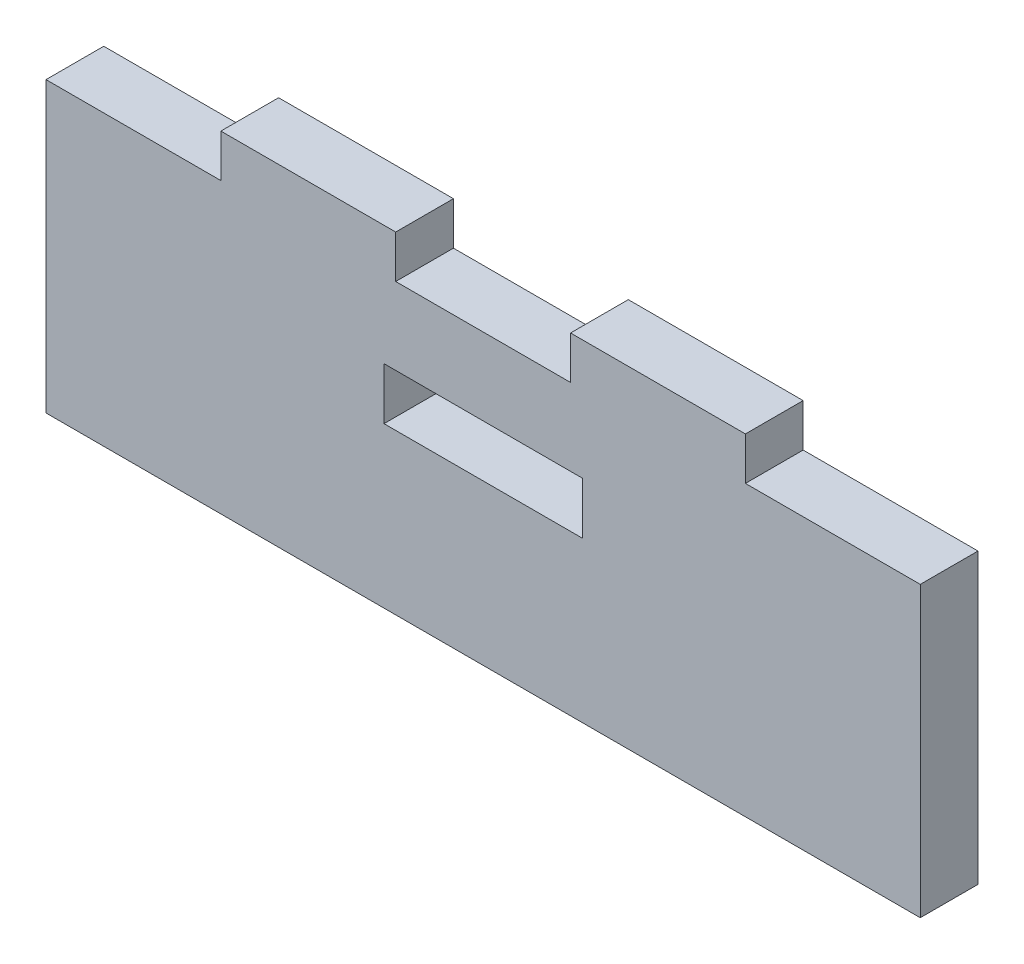
ISO-10303-21;
HEADER;
FILE_DESCRIPTION(('STEP AP214'),'2;1');
FILE_NAME('part.step','',(''),(''),'','','');
FILE_SCHEMA(('AUTOMOTIVE_DESIGN { 1 0 10303 214 1 1 1 1 }'));
ENDSEC;
DATA;
#1=APPLICATION_CONTEXT('core data for automotive mechanical design processes');
#2=APPLICATION_PROTOCOL_DEFINITION('international standard','automotive_design',2000,#1);
#3=PRODUCT_CONTEXT('',#1,'mechanical');
#4=PRODUCT('Part','Part','',(#3));
#5=PRODUCT_RELATED_PRODUCT_CATEGORY('part','',(#4));
#6=PRODUCT_DEFINITION_FORMATION('','',#4);
#7=PRODUCT_DEFINITION_CONTEXT('part definition',#1,'design');
#8=PRODUCT_DEFINITION('design','',#6,#7);
#9=PRODUCT_DEFINITION_SHAPE('','',#8);
#10=(LENGTH_UNIT() NAMED_UNIT(*) SI_UNIT(.MILLI.,.METRE.));
#11=(NAMED_UNIT(*) PLANE_ANGLE_UNIT() SI_UNIT($,.RADIAN.));
#12=(NAMED_UNIT(*) SI_UNIT($,.STERADIAN.) SOLID_ANGLE_UNIT());
#13=UNCERTAINTY_MEASURE_WITH_UNIT(LENGTH_MEASURE(1.E-05),#10,'distance_accuracy_value','');
#14=(GEOMETRIC_REPRESENTATION_CONTEXT(3) GLOBAL_UNCERTAINTY_ASSIGNED_CONTEXT((#13)) GLOBAL_UNIT_ASSIGNED_CONTEXT((#10,
#11,#12)) REPRESENTATION_CONTEXT('',''));
#15=CARTESIAN_POINT('',(0.,0.,0.));
#16=DIRECTION('',(0.,0.,1.));
#17=DIRECTION('',(1.,0.,0.));
#18=AXIS2_PLACEMENT_3D('',#15,#16,#17);
#19=CARTESIAN_POINT('',(0.,0.,3.));
#20=DIRECTION('',(0.,0.,1.));
#21=DIRECTION('',(1.,0.,0.));
#22=AXIS2_PLACEMENT_3D('',#19,#20,#21);
#23=PLANE('',#22);
#24=DIRECTION('',(0.,-1.,0.));
#25=VECTOR('',#24,1.);
#26=CARTESIAN_POINT('',(-25.5422119713162,10.7357244848707,3.));
#27=LINE('',#26,#25);
#28=CARTESIAN_POINT('',(-25.5422119713162,10.7357244848707,3.));
#29=VERTEX_POINT('',#28);
#30=CARTESIAN_POINT('',(-25.5422119713162,-4.26427551512934,3.));
#31=VERTEX_POINT('',#30);
#32=EDGE_CURVE('E181',#29,#31,#27,.T.);
#33=ORIENTED_EDGE('',*,*,#32,.T.);
#34=DIRECTION('',(1.,0.,0.));
#35=VECTOR('',#34,1.);
#36=CARTESIAN_POINT('',(-25.5422119713162,-4.26427551512934,3.));
#37=LINE('',#36,#35);
#38=CARTESIAN_POINT('',(19.8777880286838,-4.26427551512934,3.));
#39=VERTEX_POINT('',#38);
#40=EDGE_CURVE('E184',#31,#39,#37,.T.);
#41=ORIENTED_EDGE('',*,*,#40,.T.);
#42=DIRECTION('',(0.,1.,0.));
#43=VECTOR('',#42,1.);
#44=CARTESIAN_POINT('',(19.8777880286838,10.7357244848707,3.));
#45=LINE('',#44,#43);
#46=CARTESIAN_POINT('',(19.8777880286838,10.7357244848707,3.));
#47=VERTEX_POINT('',#46);
#48=EDGE_CURVE('E187',#39,#47,#45,.T.);
#49=ORIENTED_EDGE('',*,*,#48,.T.);
#50=DIRECTION('',(-1.,0.,0.));
#51=VECTOR('',#50,1.);
#52=CARTESIAN_POINT('',(10.7937880286838,10.7357244848707,3.));
#53=LINE('',#52,#51);
#54=CARTESIAN_POINT('',(10.7937880286838,10.7357244848707,3.));
#55=VERTEX_POINT('',#54);
#56=EDGE_CURVE('E189',#47,#55,#53,.T.);
#57=ORIENTED_EDGE('',*,*,#56,.T.);
#58=DIRECTION('',(0.,1.,0.));
#59=VECTOR('',#58,1.);
#60=CARTESIAN_POINT('',(10.7937880286838,10.7357244848707,3.));
#61=LINE('',#60,#59);
#62=CARTESIAN_POINT('',(10.7937880286838,12.9620559634134,3.));
#63=VERTEX_POINT('',#62);
#64=EDGE_CURVE('E191',#55,#63,#61,.T.);
#65=ORIENTED_EDGE('',*,*,#64,.T.);
#66=DIRECTION('',(-1.,0.,0.));
#67=VECTOR('',#66,1.);
#68=CARTESIAN_POINT('',(10.7937880286838,12.9620559634134,3.));
#69=LINE('',#68,#67);
#70=CARTESIAN_POINT('',(1.70978802868379,12.9620559634134,3.));
#71=VERTEX_POINT('',#70);
#72=EDGE_CURVE('E193',#63,#71,#69,.T.);
#73=ORIENTED_EDGE('',*,*,#72,.T.);
#74=DIRECTION('',(0.,-1.,0.));
#75=VECTOR('',#74,1.);
#76=CARTESIAN_POINT('',(1.70978802868379,10.7357244848707,3.));
#77=LINE('',#76,#75);
#78=CARTESIAN_POINT('',(1.70978802868379,10.7357244848707,3.));
#79=VERTEX_POINT('',#78);
#80=EDGE_CURVE('E195',#71,#79,#77,.T.);
#81=ORIENTED_EDGE('',*,*,#80,.T.);
#82=DIRECTION('',(-1.,0.,0.));
#83=VECTOR('',#82,1.);
#84=CARTESIAN_POINT('',(-7.37421197131621,10.7357244848707,3.));
#85=LINE('',#84,#83);
#86=CARTESIAN_POINT('',(-7.37421197131621,10.7357244848707,3.));
#87=VERTEX_POINT('',#86);
#88=EDGE_CURVE('E197',#79,#87,#85,.T.);
#89=ORIENTED_EDGE('',*,*,#88,.T.);
#90=DIRECTION('',(0.,1.,0.));
#91=VECTOR('',#90,1.);
#92=CARTESIAN_POINT('',(-7.37421197131621,10.7357244848707,3.));
#93=LINE('',#92,#91);
#94=CARTESIAN_POINT('',(-7.37421197131621,12.9620559634134,3.));
#95=VERTEX_POINT('',#94);
#96=EDGE_CURVE('E199',#87,#95,#93,.T.);
#97=ORIENTED_EDGE('',*,*,#96,.T.);
#98=DIRECTION('',(-1.,0.,0.));
#99=VECTOR('',#98,1.);
#100=CARTESIAN_POINT('',(-7.37421197131621,12.9620559634134,3.));
#101=LINE('',#100,#99);
#102=CARTESIAN_POINT('',(-16.4582119713162,12.9620559634134,3.));
#103=VERTEX_POINT('',#102);
#104=EDGE_CURVE('E201',#95,#103,#101,.T.);
#105=ORIENTED_EDGE('',*,*,#104,.T.);
#106=DIRECTION('',(0.,-1.,0.));
#107=VECTOR('',#106,1.);
#108=CARTESIAN_POINT('',(-16.4582119713162,10.7357244848707,3.));
#109=LINE('',#108,#107);
#110=CARTESIAN_POINT('',(-16.4582119713162,10.7357244848707,3.));
#111=VERTEX_POINT('',#110);
#112=EDGE_CURVE('E203',#103,#111,#109,.T.);
#113=ORIENTED_EDGE('',*,*,#112,.T.);
#114=DIRECTION('',(-1.,0.,0.));
#115=VECTOR('',#114,1.);
#116=CARTESIAN_POINT('',(-25.5422119713162,10.7357244848707,3.));
#117=LINE('',#116,#115);
#118=EDGE_CURVE('E205',#111,#29,#117,.T.);
#119=ORIENTED_EDGE('',*,*,#118,.T.);
#120=EDGE_LOOP('',(#33,#41,#49,#57,#65,#73,#81,#89,#97,#105,#113,#119));
#121=FACE_BOUND('',#120,.T.);
#122=DIRECTION('',(1.,0.,0.));
#123=VECTOR('',#122,1.);
#124=CARTESIAN_POINT('',(-7.9822119713162,4.03572448487066,3.));
#125=LINE('',#124,#123);
#126=CARTESIAN_POINT('',(-7.9822119713162,4.03572448487066,3.));
#127=VERTEX_POINT('',#126);
#128=CARTESIAN_POINT('',(2.3177880286838,4.03572448487066,3.));
#129=VERTEX_POINT('',#128);
#130=EDGE_CURVE('E153',#127,#129,#125,.T.);
#131=ORIENTED_EDGE('',*,*,#130,.F.);
#132=DIRECTION('',(0.,-1.,0.));
#133=VECTOR('',#132,1.);
#134=CARTESIAN_POINT('',(-7.9822119713162,6.73572448487066,3.));
#135=LINE('',#134,#133);
#136=CARTESIAN_POINT('',(-7.9822119713162,6.73572448487066,3.));
#137=VERTEX_POINT('',#136);
#138=EDGE_CURVE('E145',#137,#127,#135,.T.);
#139=ORIENTED_EDGE('',*,*,#138,.F.);
#140=DIRECTION('',(-1.,0.,0.));
#141=VECTOR('',#140,1.);
#142=CARTESIAN_POINT('',(-7.9822119713162,6.73572448487066,3.));
#143=LINE('',#142,#141);
#144=CARTESIAN_POINT('',(2.3177880286838,6.73572448487066,3.));
#145=VERTEX_POINT('',#144);
#146=EDGE_CURVE('E167',#145,#137,#143,.T.);
#147=ORIENTED_EDGE('',*,*,#146,.F.);
#148=DIRECTION('',(0.,1.,0.));
#149=VECTOR('',#148,1.);
#150=CARTESIAN_POINT('',(2.3177880286838,6.73572448487066,3.));
#151=LINE('',#150,#149);
#152=EDGE_CURVE('E165',#129,#145,#151,.T.);
#153=ORIENTED_EDGE('',*,*,#152,.F.);
#154=EDGE_LOOP('',(#131,#139,#147,#153));
#155=FACE_BOUND('',#154,.T.);
#156=ADVANCED_FACE('F32',(#121,#155),#23,.T.);
#157=CARTESIAN_POINT('',(0.,0.,0.));
#158=DIRECTION('',(0.,0.,1.));
#159=DIRECTION('',(1.,0.,0.));
#160=AXIS2_PLACEMENT_3D('',#157,#158,#159);
#161=PLANE('',#160);
#162=DIRECTION('',(0.,-1.,0.));
#163=VECTOR('',#162,1.);
#164=CARTESIAN_POINT('',(-25.5422119713162,10.7357244848707,0.));
#165=LINE('',#164,#163);
#166=CARTESIAN_POINT('',(-25.5422119713162,10.7357244848707,0.));
#167=VERTEX_POINT('',#166);
#168=CARTESIAN_POINT('',(-25.5422119713162,-4.26427551512934,0.));
#169=VERTEX_POINT('',#168);
#170=EDGE_CURVE('E161',#167,#169,#165,.T.);
#171=ORIENTED_EDGE('',*,*,#170,.F.);
#172=DIRECTION('',(-1.,0.,0.));
#173=VECTOR('',#172,1.);
#174=CARTESIAN_POINT('',(-25.5422119713162,10.7357244848707,0.));
#175=LINE('',#174,#173);
#176=CARTESIAN_POINT('',(-16.4582119713162,10.7357244848707,0.));
#177=VERTEX_POINT('',#176);
#178=EDGE_CURVE('E185',#177,#167,#175,.T.);
#179=ORIENTED_EDGE('',*,*,#178,.F.);
#180=DIRECTION('',(0.,-1.,0.));
#181=VECTOR('',#180,1.);
#182=CARTESIAN_POINT('',(-16.4582119713162,10.7357244848707,0.));
#183=LINE('',#182,#181);
#184=CARTESIAN_POINT('',(-16.4582119713162,12.9620559634134,0.));
#185=VERTEX_POINT('',#184);
#186=EDGE_CURVE('E228',#185,#177,#183,.T.);
#187=ORIENTED_EDGE('',*,*,#186,.F.);
#188=DIRECTION('',(-1.,0.,0.));
#189=VECTOR('',#188,1.);
#190=CARTESIAN_POINT('',(-7.37421197131621,12.9620559634134,0.));
#191=LINE('',#190,#189);
#192=CARTESIAN_POINT('',(-7.37421197131621,12.9620559634134,0.));
#193=VERTEX_POINT('',#192);
#194=EDGE_CURVE('E226',#193,#185,#191,.T.);
#195=ORIENTED_EDGE('',*,*,#194,.F.);
#196=DIRECTION('',(0.,1.,0.));
#197=VECTOR('',#196,1.);
#198=CARTESIAN_POINT('',(-7.37421197131621,10.7357244848707,0.));
#199=LINE('',#198,#197);
#200=CARTESIAN_POINT('',(-7.37421197131621,10.7357244848707,0.));
#201=VERTEX_POINT('',#200);
#202=EDGE_CURVE('E224',#201,#193,#199,.T.);
#203=ORIENTED_EDGE('',*,*,#202,.F.);
#204=DIRECTION('',(-1.,0.,0.));
#205=VECTOR('',#204,1.);
#206=CARTESIAN_POINT('',(-7.37421197131621,10.7357244848707,0.));
#207=LINE('',#206,#205);
#208=CARTESIAN_POINT('',(1.70978802868379,10.7357244848707,0.));
#209=VERTEX_POINT('',#208);
#210=EDGE_CURVE('E222',#209,#201,#207,.T.);
#211=ORIENTED_EDGE('',*,*,#210,.F.);
#212=DIRECTION('',(0.,-1.,0.));
#213=VECTOR('',#212,1.);
#214=CARTESIAN_POINT('',(1.70978802868379,10.7357244848707,0.));
#215=LINE('',#214,#213);
#216=CARTESIAN_POINT('',(1.70978802868379,12.9620559634134,0.));
#217=VERTEX_POINT('',#216);
#218=EDGE_CURVE('E220',#217,#209,#215,.T.);
#219=ORIENTED_EDGE('',*,*,#218,.F.);
#220=DIRECTION('',(-1.,0.,0.));
#221=VECTOR('',#220,1.);
#222=CARTESIAN_POINT('',(10.7937880286838,12.9620559634134,0.));
#223=LINE('',#222,#221);
#224=CARTESIAN_POINT('',(10.7937880286838,12.9620559634134,0.));
#225=VERTEX_POINT('',#224);
#226=EDGE_CURVE('E218',#225,#217,#223,.T.);
#227=ORIENTED_EDGE('',*,*,#226,.F.);
#228=DIRECTION('',(0.,1.,0.));
#229=VECTOR('',#228,1.);
#230=CARTESIAN_POINT('',(10.7937880286838,10.7357244848707,0.));
#231=LINE('',#230,#229);
#232=CARTESIAN_POINT('',(10.7937880286838,10.7357244848707,0.));
#233=VERTEX_POINT('',#232);
#234=EDGE_CURVE('E216',#233,#225,#231,.T.);
#235=ORIENTED_EDGE('',*,*,#234,.F.);
#236=DIRECTION('',(-1.,0.,0.));
#237=VECTOR('',#236,1.);
#238=CARTESIAN_POINT('',(10.7937880286838,10.7357244848707,0.));
#239=LINE('',#238,#237);
#240=CARTESIAN_POINT('',(19.8777880286838,10.7357244848707,0.));
#241=VERTEX_POINT('',#240);
#242=EDGE_CURVE('E214',#241,#233,#239,.T.);
#243=ORIENTED_EDGE('',*,*,#242,.F.);
#244=DIRECTION('',(0.,1.,0.));
#245=VECTOR('',#244,1.);
#246=CARTESIAN_POINT('',(19.8777880286838,10.7357244848707,0.));
#247=LINE('',#246,#245);
#248=CARTESIAN_POINT('',(19.8777880286838,-4.26427551512934,0.));
#249=VERTEX_POINT('',#248);
#250=EDGE_CURVE('E212',#249,#241,#247,.T.);
#251=ORIENTED_EDGE('',*,*,#250,.F.);
#252=DIRECTION('',(1.,0.,0.));
#253=VECTOR('',#252,1.);
#254=CARTESIAN_POINT('',(-25.5422119713162,-4.26427551512934,0.));
#255=LINE('',#254,#253);
#256=EDGE_CURVE('E210',#169,#249,#255,.T.);
#257=ORIENTED_EDGE('',*,*,#256,.F.);
#258=EDGE_LOOP('',(#171,#179,#187,#195,#203,#211,#219,#227,#235,#243,#251,#257));
#259=FACE_BOUND('',#258,.T.);
#260=DIRECTION('',(0.,-1.,0.));
#261=VECTOR('',#260,1.);
#262=CARTESIAN_POINT('',(-7.9822119713162,6.73572448487066,0.));
#263=LINE('',#262,#261);
#264=CARTESIAN_POINT('',(-7.9822119713162,6.73572448487066,0.));
#265=VERTEX_POINT('',#264);
#266=CARTESIAN_POINT('',(-7.9822119713162,4.03572448487066,0.));
#267=VERTEX_POINT('',#266);
#268=EDGE_CURVE('E55',#265,#267,#263,.T.);
#269=ORIENTED_EDGE('',*,*,#268,.T.);
#270=DIRECTION('',(1.,0.,0.));
#271=VECTOR('',#270,1.);
#272=CARTESIAN_POINT('',(-7.9822119713162,4.03572448487066,0.));
#273=LINE('',#272,#271);
#274=CARTESIAN_POINT('',(2.3177880286838,4.03572448487066,0.));
#275=VERTEX_POINT('',#274);
#276=EDGE_CURVE('E160',#267,#275,#273,.T.);
#277=ORIENTED_EDGE('',*,*,#276,.T.);
#278=DIRECTION('',(0.,1.,0.));
#279=VECTOR('',#278,1.);
#280=CARTESIAN_POINT('',(2.3177880286838,6.73572448487066,0.));
#281=LINE('',#280,#279);
#282=CARTESIAN_POINT('',(2.3177880286838,6.73572448487066,0.));
#283=VERTEX_POINT('',#282);
#284=EDGE_CURVE('E173',#275,#283,#281,.T.);
#285=ORIENTED_EDGE('',*,*,#284,.T.);
#286=DIRECTION('',(-1.,0.,0.));
#287=VECTOR('',#286,1.);
#288=CARTESIAN_POINT('',(-7.9822119713162,6.73572448487066,0.));
#289=LINE('',#288,#287);
#290=EDGE_CURVE('E154',#283,#265,#289,.T.);
#291=ORIENTED_EDGE('',*,*,#290,.T.);
#292=EDGE_LOOP('',(#269,#277,#285,#291));
#293=FACE_BOUND('',#292,.T.);
#294=ADVANCED_FACE('F270',(#259,#293),#161,.F.);
#295=CARTESIAN_POINT('',(-25.5422119713162,10.7357244848707,3.));
#296=DIRECTION('',(1.,0.,0.));
#297=DIRECTION('',(0.,1.,0.));
#298=AXIS2_PLACEMENT_3D('',#295,#296,#297);
#299=PLANE('',#298);
#300=ORIENTED_EDGE('',*,*,#170,.T.);
#301=DIRECTION('',(0.,0.,-1.));
#302=VECTOR('',#301,1.);
#303=CARTESIAN_POINT('',(-25.5422119713162,-4.26427551512934,3.));
#304=LINE('',#303,#302);
#305=EDGE_CURVE('E11',#31,#169,#304,.T.);
#306=ORIENTED_EDGE('',*,*,#305,.F.);
#307=ORIENTED_EDGE('',*,*,#32,.F.);
#308=DIRECTION('',(0.,0.,-1.));
#309=VECTOR('',#308,1.);
#310=CARTESIAN_POINT('',(-25.5422119713162,10.7357244848707,3.));
#311=LINE('',#310,#309);
#312=EDGE_CURVE('E207',#29,#167,#311,.T.);
#313=ORIENTED_EDGE('',*,*,#312,.T.);
#314=EDGE_LOOP('',(#300,#306,#307,#313));
#315=FACE_BOUND('',#314,.T.);
#316=ADVANCED_FACE('F34',(#315),#299,.F.);
#317=CARTESIAN_POINT('',(-25.5422119713162,-4.26427551512934,3.));
#318=DIRECTION('',(0.,1.,0.));
#319=DIRECTION('',(0.,0.,1.));
#320=AXIS2_PLACEMENT_3D('',#317,#318,#319);
#321=PLANE('',#320);
#322=ORIENTED_EDGE('',*,*,#256,.T.);
#323=DIRECTION('',(0.,0.,-1.));
#324=VECTOR('',#323,1.);
#325=CARTESIAN_POINT('',(19.8777880286838,-4.26427551512934,3.));
#326=LINE('',#325,#324);
#327=EDGE_CURVE('E40',#39,#249,#326,.T.);
#328=ORIENTED_EDGE('',*,*,#327,.F.);
#329=ORIENTED_EDGE('',*,*,#40,.F.);
#330=ORIENTED_EDGE('',*,*,#305,.T.);
#331=EDGE_LOOP('',(#322,#328,#329,#330));
#332=FACE_BOUND('',#331,.T.);
#333=ADVANCED_FACE('F287',(#332),#321,.F.);
#334=CARTESIAN_POINT('',(19.8777880286838,10.7357244848707,3.));
#335=DIRECTION('',(-1.,0.,0.));
#336=DIRECTION('',(0.,-1.,0.));
#337=AXIS2_PLACEMENT_3D('',#334,#335,#336);
#338=PLANE('',#337);
#339=ORIENTED_EDGE('',*,*,#250,.T.);
#340=DIRECTION('',(0.,0.,-1.));
#341=VECTOR('',#340,1.);
#342=CARTESIAN_POINT('',(19.8777880286838,10.7357244848707,3.));
#343=LINE('',#342,#341);
#344=EDGE_CURVE('E257',#47,#241,#343,.T.);
#345=ORIENTED_EDGE('',*,*,#344,.F.);
#346=ORIENTED_EDGE('',*,*,#48,.F.);
#347=ORIENTED_EDGE('',*,*,#327,.T.);
#348=EDGE_LOOP('',(#339,#345,#346,#347));
#349=FACE_BOUND('',#348,.T.);
#350=ADVANCED_FACE('F264',(#349),#338,.F.);
#351=CARTESIAN_POINT('',(10.7937880286838,10.7357244848707,3.));
#352=DIRECTION('',(0.,-1.,0.));
#353=DIRECTION('',(1.,0.,0.));
#354=AXIS2_PLACEMENT_3D('',#351,#352,#353);
#355=PLANE('',#354);
#356=ORIENTED_EDGE('',*,*,#242,.T.);
#357=DIRECTION('',(0.,0.,-1.));
#358=VECTOR('',#357,1.);
#359=CARTESIAN_POINT('',(10.7937880286838,10.7357244848707,3.));
#360=LINE('',#359,#358);
#361=EDGE_CURVE('E254',#55,#233,#360,.T.);
#362=ORIENTED_EDGE('',*,*,#361,.F.);
#363=ORIENTED_EDGE('',*,*,#56,.F.);
#364=ORIENTED_EDGE('',*,*,#344,.T.);
#365=EDGE_LOOP('',(#356,#362,#363,#364));
#366=FACE_BOUND('',#365,.T.);
#367=ADVANCED_FACE('F276',(#366),#355,.F.);
#368=CARTESIAN_POINT('',(10.7937880286838,10.7357244848707,3.));
#369=DIRECTION('',(-1.,0.,0.));
#370=DIRECTION('',(0.,0.,1.));
#371=AXIS2_PLACEMENT_3D('',#368,#369,#370);
#372=PLANE('',#371);
#373=ORIENTED_EDGE('',*,*,#234,.T.);
#374=DIRECTION('',(0.,0.,-1.));
#375=VECTOR('',#374,1.);
#376=CARTESIAN_POINT('',(10.7937880286838,12.9620559634134,3.));
#377=LINE('',#376,#375);
#378=EDGE_CURVE('E251',#63,#225,#377,.T.);
#379=ORIENTED_EDGE('',*,*,#378,.F.);
#380=ORIENTED_EDGE('',*,*,#64,.F.);
#381=ORIENTED_EDGE('',*,*,#361,.T.);
#382=EDGE_LOOP('',(#373,#379,#380,#381));
#383=FACE_BOUND('',#382,.T.);
#384=ADVANCED_FACE('F280',(#383),#372,.F.);
#385=CARTESIAN_POINT('',(10.7937880286838,12.9620559634134,3.));
#386=DIRECTION('',(0.,-1.,0.));
#387=DIRECTION('',(1.,0.,0.));
#388=AXIS2_PLACEMENT_3D('',#385,#386,#387);
#389=PLANE('',#388);
#390=ORIENTED_EDGE('',*,*,#226,.T.);
#391=DIRECTION('',(0.,0.,-1.));
#392=VECTOR('',#391,1.);
#393=CARTESIAN_POINT('',(1.70978802868379,12.9620559634134,3.));
#394=LINE('',#393,#392);
#395=EDGE_CURVE('E248',#71,#217,#394,.T.);
#396=ORIENTED_EDGE('',*,*,#395,.F.);
#397=ORIENTED_EDGE('',*,*,#72,.F.);
#398=ORIENTED_EDGE('',*,*,#378,.T.);
#399=EDGE_LOOP('',(#390,#396,#397,#398));
#400=FACE_BOUND('',#399,.T.);
#401=ADVANCED_FACE('F320',(#400),#389,.F.);
#402=CARTESIAN_POINT('',(1.70978802868379,10.7357244848707,3.));
#403=DIRECTION('',(1.,0.,0.));
#404=DIRECTION('',(0.,1.,0.));
#405=AXIS2_PLACEMENT_3D('',#402,#403,#404);
#406=PLANE('',#405);
#407=ORIENTED_EDGE('',*,*,#218,.T.);
#408=DIRECTION('',(0.,0.,-1.));
#409=VECTOR('',#408,1.);
#410=CARTESIAN_POINT('',(1.70978802868379,10.7357244848707,3.));
#411=LINE('',#410,#409);
#412=EDGE_CURVE('E245',#79,#209,#411,.T.);
#413=ORIENTED_EDGE('',*,*,#412,.F.);
#414=ORIENTED_EDGE('',*,*,#80,.F.);
#415=ORIENTED_EDGE('',*,*,#395,.T.);
#416=EDGE_LOOP('',(#407,#413,#414,#415));
#417=FACE_BOUND('',#416,.T.);
#418=ADVANCED_FACE('F318',(#417),#406,.F.);
#419=CARTESIAN_POINT('',(-7.37421197131621,10.7357244848707,3.));
#420=DIRECTION('',(0.,-1.,0.));
#421=DIRECTION('',(0.,0.,-1.));
#422=AXIS2_PLACEMENT_3D('',#419,#420,#421);
#423=PLANE('',#422);
#424=ORIENTED_EDGE('',*,*,#210,.T.);
#425=DIRECTION('',(0.,0.,-1.));
#426=VECTOR('',#425,1.);
#427=CARTESIAN_POINT('',(-7.37421197131621,10.7357244848707,3.));
#428=LINE('',#427,#426);
#429=EDGE_CURVE('E242',#87,#201,#428,.T.);
#430=ORIENTED_EDGE('',*,*,#429,.F.);
#431=ORIENTED_EDGE('',*,*,#88,.F.);
#432=ORIENTED_EDGE('',*,*,#412,.T.);
#433=EDGE_LOOP('',(#424,#430,#431,#432));
#434=FACE_BOUND('',#433,.T.);
#435=ADVANCED_FACE('F314',(#434),#423,.F.);
#436=CARTESIAN_POINT('',(-7.37421197131621,10.7357244848707,3.));
#437=DIRECTION('',(-1.,0.,0.));
#438=DIRECTION('',(0.,0.,1.));
#439=AXIS2_PLACEMENT_3D('',#436,#437,#438);
#440=PLANE('',#439);
#441=ORIENTED_EDGE('',*,*,#202,.T.);
#442=DIRECTION('',(0.,0.,-1.));
#443=VECTOR('',#442,1.);
#444=CARTESIAN_POINT('',(-7.37421197131621,12.9620559634134,3.));
#445=LINE('',#444,#443);
#446=EDGE_CURVE('E239',#95,#193,#445,.T.);
#447=ORIENTED_EDGE('',*,*,#446,.F.);
#448=ORIENTED_EDGE('',*,*,#96,.F.);
#449=ORIENTED_EDGE('',*,*,#429,.T.);
#450=EDGE_LOOP('',(#441,#447,#448,#449));
#451=FACE_BOUND('',#450,.T.);
#452=ADVANCED_FACE('F309',(#451),#440,.F.);
#453=CARTESIAN_POINT('',(-7.37421197131621,12.9620559634134,3.));
#454=DIRECTION('',(0.,-1.,0.));
#455=DIRECTION('',(1.,0.,0.));
#456=AXIS2_PLACEMENT_3D('',#453,#454,#455);
#457=PLANE('',#456);
#458=ORIENTED_EDGE('',*,*,#194,.T.);
#459=DIRECTION('',(0.,0.,-1.));
#460=VECTOR('',#459,1.);
#461=CARTESIAN_POINT('',(-16.4582119713162,12.9620559634134,3.));
#462=LINE('',#461,#460);
#463=EDGE_CURVE('E236',#103,#185,#462,.T.);
#464=ORIENTED_EDGE('',*,*,#463,.F.);
#465=ORIENTED_EDGE('',*,*,#104,.F.);
#466=ORIENTED_EDGE('',*,*,#446,.T.);
#467=EDGE_LOOP('',(#458,#464,#465,#466));
#468=FACE_BOUND('',#467,.T.);
#469=ADVANCED_FACE('F303',(#468),#457,.F.);
#470=CARTESIAN_POINT('',(-16.4582119713162,10.7357244848707,3.));
#471=DIRECTION('',(1.,0.,0.));
#472=DIRECTION('',(0.,0.,-1.));
#473=AXIS2_PLACEMENT_3D('',#470,#471,#472);
#474=PLANE('',#473);
#475=ORIENTED_EDGE('',*,*,#186,.T.);
#476=DIRECTION('',(0.,0.,-1.));
#477=VECTOR('',#476,1.);
#478=CARTESIAN_POINT('',(-16.4582119713162,10.7357244848707,3.));
#479=LINE('',#478,#477);
#480=EDGE_CURVE('E233',#111,#177,#479,.T.);
#481=ORIENTED_EDGE('',*,*,#480,.F.);
#482=ORIENTED_EDGE('',*,*,#112,.F.);
#483=ORIENTED_EDGE('',*,*,#463,.T.);
#484=EDGE_LOOP('',(#475,#481,#482,#483));
#485=FACE_BOUND('',#484,.T.);
#486=ADVANCED_FACE('F299',(#485),#474,.F.);
#487=CARTESIAN_POINT('',(-25.5422119713162,10.7357244848707,3.));
#488=DIRECTION('',(0.,-1.,0.));
#489=DIRECTION('',(1.,0.,0.));
#490=AXIS2_PLACEMENT_3D('',#487,#488,#489);
#491=PLANE('',#490);
#492=ORIENTED_EDGE('',*,*,#178,.T.);
#493=ORIENTED_EDGE('',*,*,#312,.F.);
#494=ORIENTED_EDGE('',*,*,#118,.F.);
#495=ORIENTED_EDGE('',*,*,#480,.T.);
#496=EDGE_LOOP('',(#492,#493,#494,#495));
#497=FACE_BOUND('',#496,.T.);
#498=ADVANCED_FACE('F294',(#497),#491,.F.);
#499=CARTESIAN_POINT('',(-7.9822119713162,6.73572448487066,3.));
#500=DIRECTION('',(1.,0.,0.));
#501=DIRECTION('',(0.,1.,0.));
#502=AXIS2_PLACEMENT_3D('',#499,#500,#501);
#503=PLANE('',#502);
#504=ORIENTED_EDGE('',*,*,#268,.F.);
#505=DIRECTION('',(0.,0.,-1.));
#506=VECTOR('',#505,1.);
#507=CARTESIAN_POINT('',(-7.9822119713162,6.73572448487066,3.));
#508=LINE('',#507,#506);
#509=EDGE_CURVE('E149',#137,#265,#508,.T.);
#510=ORIENTED_EDGE('',*,*,#509,.F.);
#511=ORIENTED_EDGE('',*,*,#138,.T.);
#512=DIRECTION('',(0.,0.,-1.));
#513=VECTOR('',#512,1.);
#514=CARTESIAN_POINT('',(-7.9822119713162,4.03572448487066,3.));
#515=LINE('',#514,#513);
#516=EDGE_CURVE('E148',#127,#267,#515,.T.);
#517=ORIENTED_EDGE('',*,*,#516,.T.);
#518=EDGE_LOOP('',(#504,#510,#511,#517));
#519=FACE_BOUND('',#518,.T.);
#520=ADVANCED_FACE('F147',(#519),#503,.T.);
#521=CARTESIAN_POINT('',(-7.9822119713162,4.03572448487066,3.));
#522=DIRECTION('',(0.,1.,0.));
#523=DIRECTION('',(0.,0.,1.));
#524=AXIS2_PLACEMENT_3D('',#521,#522,#523);
#525=PLANE('',#524);
#526=ORIENTED_EDGE('',*,*,#276,.F.);
#527=ORIENTED_EDGE('',*,*,#516,.F.);
#528=ORIENTED_EDGE('',*,*,#130,.T.);
#529=DIRECTION('',(0.,0.,-1.));
#530=VECTOR('',#529,1.);
#531=CARTESIAN_POINT('',(2.3177880286838,4.03572448487066,3.));
#532=LINE('',#531,#530);
#533=EDGE_CURVE('E162',#129,#275,#532,.T.);
#534=ORIENTED_EDGE('',*,*,#533,.T.);
#535=EDGE_LOOP('',(#526,#527,#528,#534));
#536=FACE_BOUND('',#535,.T.);
#537=ADVANCED_FACE('F157',(#536),#525,.T.);
#538=CARTESIAN_POINT('',(2.3177880286838,6.73572448487066,3.));
#539=DIRECTION('',(-1.,0.,0.));
#540=DIRECTION('',(0.,0.,1.));
#541=AXIS2_PLACEMENT_3D('',#538,#539,#540);
#542=PLANE('',#541);
#543=ORIENTED_EDGE('',*,*,#284,.F.);
#544=ORIENTED_EDGE('',*,*,#533,.F.);
#545=ORIENTED_EDGE('',*,*,#152,.T.);
#546=DIRECTION('',(0.,0.,-1.));
#547=VECTOR('',#546,1.);
#548=CARTESIAN_POINT('',(2.3177880286838,6.73572448487066,3.));
#549=LINE('',#548,#547);
#550=EDGE_CURVE('E47',#145,#283,#549,.T.);
#551=ORIENTED_EDGE('',*,*,#550,.T.);
#552=EDGE_LOOP('',(#543,#544,#545,#551));
#553=FACE_BOUND('',#552,.T.);
#554=ADVANCED_FACE('F378',(#553),#542,.T.);
#555=CARTESIAN_POINT('',(-7.9822119713162,6.73572448487066,3.));
#556=DIRECTION('',(0.,-1.,0.));
#557=DIRECTION('',(1.,0.,0.));
#558=AXIS2_PLACEMENT_3D('',#555,#556,#557);
#559=PLANE('',#558);
#560=ORIENTED_EDGE('',*,*,#290,.F.);
#561=ORIENTED_EDGE('',*,*,#550,.F.);
#562=ORIENTED_EDGE('',*,*,#146,.T.);
#563=ORIENTED_EDGE('',*,*,#509,.T.);
#564=EDGE_LOOP('',(#560,#561,#562,#563));
#565=FACE_BOUND('',#564,.T.);
#566=ADVANCED_FACE('F384',(#565),#559,.T.);
#567=CLOSED_SHELL('',(#156,#294,#316,#333,#350,#367,#384,#401,#418,#435,#452,#469,#486,#498,
#520,#537,#554,#566));
#568=MANIFOLD_SOLID_BREP('B2',#567);
#569=ADVANCED_BREP_SHAPE_REPRESENTATION('',(#18,#568),#14);
#570=SHAPE_DEFINITION_REPRESENTATION(#9,#569);
ENDSEC;
END-ISO-10303-21;
